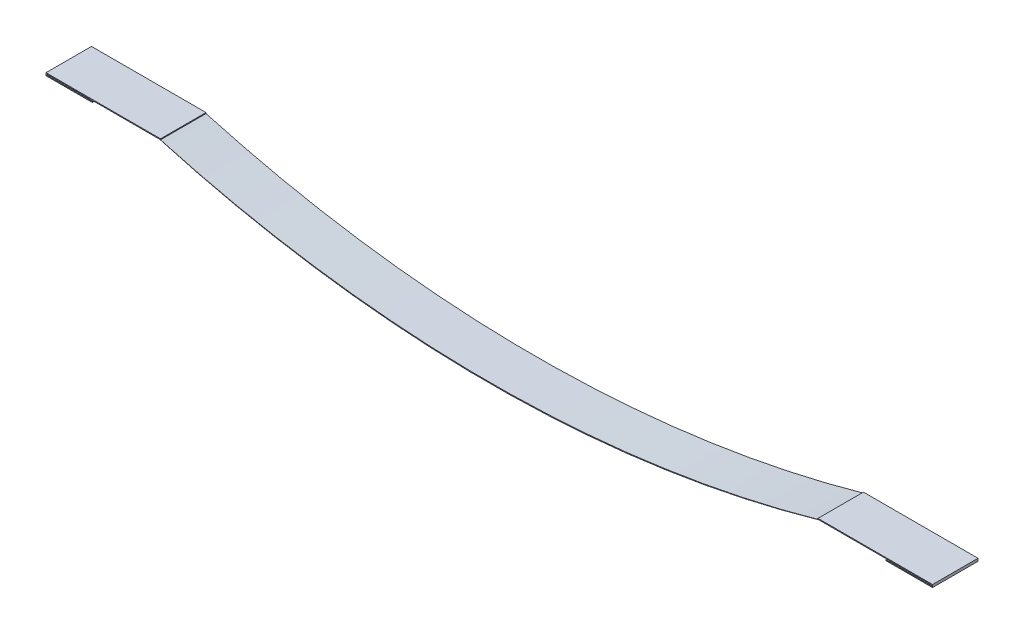
ISO-10303-21;
HEADER;
FILE_DESCRIPTION(('STEP AP214'),'2;1');
FILE_NAME('part.step','',(''),(''),'','','');
FILE_SCHEMA(('AUTOMOTIVE_DESIGN { 1 0 10303 214 1 1 1 1 }'));
ENDSEC;
DATA;
#1=APPLICATION_CONTEXT('core data for automotive mechanical design processes');
#2=APPLICATION_PROTOCOL_DEFINITION('international standard','automotive_design',2000,#1);
#3=PRODUCT_CONTEXT('',#1,'mechanical');
#4=PRODUCT('Part','Part','',(#3));
#5=PRODUCT_RELATED_PRODUCT_CATEGORY('part','',(#4));
#6=PRODUCT_DEFINITION_FORMATION('','',#4);
#7=PRODUCT_DEFINITION_CONTEXT('part definition',#1,'design');
#8=PRODUCT_DEFINITION('design','',#6,#7);
#9=PRODUCT_DEFINITION_SHAPE('','',#8);
#10=(LENGTH_UNIT() NAMED_UNIT(*) SI_UNIT(.MILLI.,.METRE.));
#11=(NAMED_UNIT(*) PLANE_ANGLE_UNIT() SI_UNIT($,.RADIAN.));
#12=(NAMED_UNIT(*) SI_UNIT($,.STERADIAN.) SOLID_ANGLE_UNIT());
#13=UNCERTAINTY_MEASURE_WITH_UNIT(LENGTH_MEASURE(1.E-05),#10,'distance_accuracy_value','');
#14=(GEOMETRIC_REPRESENTATION_CONTEXT(3) GLOBAL_UNCERTAINTY_ASSIGNED_CONTEXT((#13)) GLOBAL_UNIT_ASSIGNED_CONTEXT((#10,
#11,#12)) REPRESENTATION_CONTEXT('',''));
#15=CARTESIAN_POINT('',(0.,0.,0.));
#16=DIRECTION('',(0.,0.,1.));
#17=DIRECTION('',(1.,0.,0.));
#18=AXIS2_PLACEMENT_3D('',#15,#16,#17);
#19=CARTESIAN_POINT('',(-1.38777878078145E-13,1283.41361003861,50.8));
#20=DIRECTION('',(0.,0.,1.));
#21=DIRECTION('',(1.,0.,0.));
#22=AXIS2_PLACEMENT_3D('',#19,#20,#21);
#23=PLANE('',#22);
#24=DIRECTION('',(1.,0.,0.));
#25=VECTOR('',#24,1.);
#26=CARTESIAN_POINT('',(-495.3,-1.99999999999996,50.8));
#27=LINE('',#26,#25);
#28=CARTESIAN_POINT('',(-495.3,-1.99999999999996,50.8));
#29=VERTEX_POINT('',#28);
#30=CARTESIAN_POINT('',(-443.5,-1.99999999999995,50.8));
#31=VERTEX_POINT('',#30);
#32=EDGE_CURVE('E286',#29,#31,#27,.T.);
#33=ORIENTED_EDGE('',*,*,#32,.T.);
#34=DIRECTION('',(0.,1.,0.));
#35=VECTOR('',#34,1.);
#36=CARTESIAN_POINT('',(-443.5,-1.99999999999995,50.8));
#37=LINE('',#36,#35);
#38=CARTESIAN_POINT('',(-443.5,0.,50.8));
#39=VERTEX_POINT('',#38);
#40=EDGE_CURVE('E289',#31,#39,#37,.T.);
#41=ORIENTED_EDGE('',*,*,#40,.T.);
#42=DIRECTION('',(1.,0.,0.));
#43=VECTOR('',#42,1.);
#44=CARTESIAN_POINT('',(-368.3,0.,50.8));
#45=LINE('',#44,#43);
#46=CARTESIAN_POINT('',(-368.3,2.22044604925031E-13,50.8));
#47=VERTEX_POINT('',#46);
#48=EDGE_CURVE('E293',#39,#47,#45,.T.);
#49=ORIENTED_EDGE('',*,*,#48,.T.);
#50=CARTESIAN_POINT('',(-1.38777878078145E-13,1283.41361003861,50.8));
#51=DIRECTION('',(0.,0.,1.));
#52=DIRECTION('',(1.,0.,0.));
#53=AXIS2_PLACEMENT_3D('',#50,#51,#52);
#54=CIRCLE('',#53,1335.21361003861);
#55=CARTESIAN_POINT('',(368.3,1.14710452323366E-13,50.8));
#56=VERTEX_POINT('',#55);
#57=EDGE_CURVE('E296',#47,#56,#54,.T.);
#58=ORIENTED_EDGE('',*,*,#57,.T.);
#59=DIRECTION('',(1.,0.,0.));
#60=VECTOR('',#59,1.);
#61=CARTESIAN_POINT('',(368.3,1.14710452323366E-13,50.8));
#62=LINE('',#61,#60);
#63=CARTESIAN_POINT('',(443.5,1.23919796252954E-13,50.8));
#64=VERTEX_POINT('',#63);
#65=EDGE_CURVE('E299',#56,#64,#62,.T.);
#66=ORIENTED_EDGE('',*,*,#65,.T.);
#67=DIRECTION('',(0.,-1.,0.));
#68=VECTOR('',#67,1.);
#69=CARTESIAN_POINT('',(443.5,-1.99999999999984,50.8));
#70=LINE('',#69,#68);
#71=CARTESIAN_POINT('',(443.5,-1.99999999999984,50.8));
#72=VERTEX_POINT('',#71);
#73=EDGE_CURVE('E302',#64,#72,#70,.T.);
#74=ORIENTED_EDGE('',*,*,#73,.T.);
#75=DIRECTION('',(1.,0.,0.));
#76=VECTOR('',#75,1.);
#77=CARTESIAN_POINT('',(444.5,-1.99999999999985,50.8));
#78=LINE('',#77,#76);
#79=CARTESIAN_POINT('',(495.3,-1.99999999999983,50.8));
#80=VERTEX_POINT('',#79);
#81=EDGE_CURVE('E305',#72,#80,#78,.T.);
#82=ORIENTED_EDGE('',*,*,#81,.T.);
#83=DIRECTION('',(0.,1.,0.));
#84=VECTOR('',#83,1.);
#85=CARTESIAN_POINT('',(495.3,1.00000000000014,50.8));
#86=LINE('',#85,#84);
#87=CARTESIAN_POINT('',(495.3,1.00000000000014,50.8));
#88=VERTEX_POINT('',#87);
#89=EDGE_CURVE('E308',#80,#88,#86,.T.);
#90=ORIENTED_EDGE('',*,*,#89,.T.);
#91=DIRECTION('',(-1.,0.,0.));
#92=VECTOR('',#91,1.);
#93=CARTESIAN_POINT('',(444.5,1.00000000000015,50.8));
#94=LINE('',#93,#92);
#95=CARTESIAN_POINT('',(367.3,1.00000000000011,50.8));
#96=VERTEX_POINT('',#95);
#97=EDGE_CURVE('E311',#88,#96,#94,.T.);
#98=ORIENTED_EDGE('',*,*,#97,.T.);
#99=DIRECTION('',(0.,-1.,0.));
#100=VECTOR('',#99,1.);
#101=CARTESIAN_POINT('',(367.3,1.00000000000011,50.8));
#102=LINE('',#101,#100);
#103=CARTESIAN_POINT('',(367.3,2.22044604925031E-13,50.8));
#104=VERTEX_POINT('',#103);
#105=EDGE_CURVE('E314',#96,#104,#102,.T.);
#106=ORIENTED_EDGE('',*,*,#105,.T.);
#107=CARTESIAN_POINT('',(-1.66533453693773E-13,1302.44734251968,50.8));
#108=DIRECTION('',(0.,0.,-1.));
#109=DIRECTION('',(1.,0.,0.));
#110=AXIS2_PLACEMENT_3D('',#107,#108,#109);
#111=CIRCLE('',#110,1353.24734251968);
#112=CARTESIAN_POINT('',(-367.3,0.,50.8));
#113=VERTEX_POINT('',#112);
#114=EDGE_CURVE('E317',#104,#113,#111,.T.);
#115=ORIENTED_EDGE('',*,*,#114,.T.);
#116=DIRECTION('',(0.,1.,0.));
#117=VECTOR('',#116,1.);
#118=CARTESIAN_POINT('',(-367.3,1.00000000000002,50.8));
#119=LINE('',#118,#117);
#120=CARTESIAN_POINT('',(-367.3,1.00000000000002,50.8));
#121=VERTEX_POINT('',#120);
#122=EDGE_CURVE('E320',#113,#121,#119,.T.);
#123=ORIENTED_EDGE('',*,*,#122,.T.);
#124=DIRECTION('',(-1.,0.,0.));
#125=VECTOR('',#124,1.);
#126=CARTESIAN_POINT('',(-368.3,1.00000000000002,50.8));
#127=LINE('',#126,#125);
#128=CARTESIAN_POINT('',(-495.3,1.00000000000001,50.8));
#129=VERTEX_POINT('',#128);
#130=EDGE_CURVE('E323',#121,#129,#127,.T.);
#131=ORIENTED_EDGE('',*,*,#130,.T.);
#132=DIRECTION('',(0.,-1.,0.));
#133=VECTOR('',#132,1.);
#134=CARTESIAN_POINT('',(-495.3,1.00000000000001,50.8));
#135=LINE('',#134,#133);
#136=EDGE_CURVE('E326',#129,#29,#135,.T.);
#137=ORIENTED_EDGE('',*,*,#136,.T.);
#138=EDGE_LOOP('',(#33,#41,#49,#58,#66,#74,#82,#90,#98,#106,#115,#123,#131,#137));
#139=FACE_BOUND('',#138,.T.);
#140=DIRECTION('',(0.,1.,0.));
#141=VECTOR('',#140,1.);
#142=CARTESIAN_POINT('',(-444.5,-0.999999999999956,50.8));
#143=LINE('',#142,#141);
#144=CARTESIAN_POINT('',(-444.5,-0.999999999999956,50.8));
#145=VERTEX_POINT('',#144);
#146=CARTESIAN_POINT('',(-444.5,0.,50.8));
#147=VERTEX_POINT('',#146);
#148=EDGE_CURVE('E246',#145,#147,#143,.T.);
#149=ORIENTED_EDGE('',*,*,#148,.F.);
#150=DIRECTION('',(1.,0.,0.));
#151=VECTOR('',#150,1.);
#152=CARTESIAN_POINT('',(-494.3,-0.999999999999967,50.8));
#153=LINE('',#152,#151);
#154=CARTESIAN_POINT('',(-494.3,-0.999999999999967,50.8));
#155=VERTEX_POINT('',#154);
#156=EDGE_CURVE('E243',#155,#145,#153,.T.);
#157=ORIENTED_EDGE('',*,*,#156,.F.);
#158=DIRECTION('',(0.,-1.,0.));
#159=VECTOR('',#158,1.);
#160=CARTESIAN_POINT('',(-494.3,0.,50.8));
#161=LINE('',#160,#159);
#162=CARTESIAN_POINT('',(-494.3,0.,50.8));
#163=VERTEX_POINT('',#162);
#164=EDGE_CURVE('E254',#163,#155,#161,.T.);
#165=ORIENTED_EDGE('',*,*,#164,.F.);
#166=DIRECTION('',(-1.,0.,0.));
#167=VECTOR('',#166,1.);
#168=CARTESIAN_POINT('',(-444.5,0.,50.8));
#169=LINE('',#168,#167);
#170=EDGE_CURVE('E250',#147,#163,#169,.T.);
#171=ORIENTED_EDGE('',*,*,#170,.F.);
#172=EDGE_LOOP('',(#149,#157,#165,#171));
#173=FACE_BOUND('',#172,.T.);
#174=DIRECTION('',(0.,-1.,0.));
#175=VECTOR('',#174,1.);
#176=CARTESIAN_POINT('',(444.5,-0.999999999999847,50.8));
#177=LINE('',#176,#175);
#178=CARTESIAN_POINT('',(444.5,1.53323389516105E-13,50.8));
#179=VERTEX_POINT('',#178);
#180=CARTESIAN_POINT('',(444.5,-0.999999999999847,50.8));
#181=VERTEX_POINT('',#180);
#182=EDGE_CURVE('E204',#179,#181,#177,.T.);
#183=ORIENTED_EDGE('',*,*,#182,.F.);
#184=DIRECTION('',(-1.,0.,0.));
#185=VECTOR('',#184,1.);
#186=CARTESIAN_POINT('',(444.5,1.53323389516105E-13,50.8));
#187=LINE('',#186,#185);
#188=CARTESIAN_POINT('',(494.3,1.32344285157557E-13,50.8));
#189=VERTEX_POINT('',#188);
#190=EDGE_CURVE('E195',#189,#179,#187,.T.);
#191=ORIENTED_EDGE('',*,*,#190,.F.);
#192=DIRECTION('',(0.,1.,0.));
#193=VECTOR('',#192,1.);
#194=CARTESIAN_POINT('',(494.3,1.32344285157557E-13,50.8));
#195=LINE('',#194,#193);
#196=CARTESIAN_POINT('',(494.3,-0.99999999999989,50.8));
#197=VERTEX_POINT('',#196);
#198=EDGE_CURVE('E221',#197,#189,#195,.T.);
#199=ORIENTED_EDGE('',*,*,#198,.F.);
#200=DIRECTION('',(1.,0.,0.));
#201=VECTOR('',#200,1.);
#202=CARTESIAN_POINT('',(494.3,-0.999999999999846,50.8));
#203=LINE('',#202,#201);
#204=EDGE_CURVE('E217',#181,#197,#203,.T.);
#205=ORIENTED_EDGE('',*,*,#204,.F.);
#206=EDGE_LOOP('',(#183,#191,#199,#205));
#207=FACE_BOUND('',#206,.T.);
#208=ADVANCED_FACE('F45',(#139,#173,#207),#23,.T.);
#209=CARTESIAN_POINT('',(-1.38777878078145E-13,1283.41361003861,0.));
#210=DIRECTION('',(0.,0.,1.));
#211=DIRECTION('',(1.,0.,0.));
#212=AXIS2_PLACEMENT_3D('',#209,#210,#211);
#213=PLANE('',#212);
#214=DIRECTION('',(1.,0.,0.));
#215=VECTOR('',#214,1.);
#216=CARTESIAN_POINT('',(-494.3,-0.999999999999967,0.));
#217=LINE('',#216,#215);
#218=CARTESIAN_POINT('',(-494.3,-1.00000000000011,0.));
#219=VERTEX_POINT('',#218);
#220=CARTESIAN_POINT('',(-444.5,-0.999999999999956,0.));
#221=VERTEX_POINT('',#220);
#222=EDGE_CURVE('E213',#219,#221,#217,.T.);
#223=ORIENTED_EDGE('',*,*,#222,.T.);
#224=DIRECTION('',(0.,1.,0.));
#225=VECTOR('',#224,1.);
#226=CARTESIAN_POINT('',(-444.5,-0.999999999999956,0.));
#227=LINE('',#226,#225);
#228=CARTESIAN_POINT('',(-444.5,0.,0.));
#229=VERTEX_POINT('',#228);
#230=EDGE_CURVE('E261',#221,#229,#227,.T.);
#231=ORIENTED_EDGE('',*,*,#230,.T.);
#232=DIRECTION('',(-1.,0.,0.));
#233=VECTOR('',#232,1.);
#234=CARTESIAN_POINT('',(-444.5,0.,0.));
#235=LINE('',#234,#233);
#236=CARTESIAN_POINT('',(-494.3,0.,0.));
#237=VERTEX_POINT('',#236);
#238=EDGE_CURVE('E265',#229,#237,#235,.T.);
#239=ORIENTED_EDGE('',*,*,#238,.T.);
#240=DIRECTION('',(0.,-1.,0.));
#241=VECTOR('',#240,1.);
#242=CARTESIAN_POINT('',(-494.3,0.,0.));
#243=LINE('',#242,#241);
#244=EDGE_CURVE('E247',#237,#219,#243,.T.);
#245=ORIENTED_EDGE('',*,*,#244,.T.);
#246=EDGE_LOOP('',(#223,#231,#239,#245));
#247=FACE_BOUND('',#246,.T.);
#248=DIRECTION('',(1.,0.,0.));
#249=VECTOR('',#248,1.);
#250=CARTESIAN_POINT('',(-444.5,-1.99999999999996,0.));
#251=LINE('',#250,#249);
#252=CARTESIAN_POINT('',(-495.3,-1.99999999999996,0.));
#253=VERTEX_POINT('',#252);
#254=CARTESIAN_POINT('',(-443.5,-1.99999999999995,0.));
#255=VERTEX_POINT('',#254);
#256=EDGE_CURVE('E285',#253,#255,#251,.T.);
#257=ORIENTED_EDGE('',*,*,#256,.F.);
#258=DIRECTION('',(0.,-1.,0.));
#259=VECTOR('',#258,1.);
#260=CARTESIAN_POINT('',(-495.3,1.00000000000001,0.));
#261=LINE('',#260,#259);
#262=CARTESIAN_POINT('',(-495.3,1.00000000000001,0.));
#263=VERTEX_POINT('',#262);
#264=EDGE_CURVE('E290',#263,#253,#261,.T.);
#265=ORIENTED_EDGE('',*,*,#264,.F.);
#266=DIRECTION('',(-1.,0.,0.));
#267=VECTOR('',#266,1.);
#268=CARTESIAN_POINT('',(-444.5,1.00000000000004,0.));
#269=LINE('',#268,#267);
#270=CARTESIAN_POINT('',(-367.3,1.00000000000002,0.));
#271=VERTEX_POINT('',#270);
#272=EDGE_CURVE('E368',#271,#263,#269,.T.);
#273=ORIENTED_EDGE('',*,*,#272,.F.);
#274=DIRECTION('',(0.,1.,0.));
#275=VECTOR('',#274,1.);
#276=CARTESIAN_POINT('',(-367.3,1.00000000000002,0.));
#277=LINE('',#276,#275);
#278=CARTESIAN_POINT('',(-367.3,0.,0.));
#279=VERTEX_POINT('',#278);
#280=EDGE_CURVE('E364',#279,#271,#277,.T.);
#281=ORIENTED_EDGE('',*,*,#280,.F.);
#282=CARTESIAN_POINT('',(-1.66533453693773E-13,1302.44734251968,0.));
#283=DIRECTION('',(0.,0.,-1.));
#284=DIRECTION('',(1.,0.,0.));
#285=AXIS2_PLACEMENT_3D('',#282,#283,#284);
#286=CIRCLE('',#285,1353.24734251968);
#287=CARTESIAN_POINT('',(367.3,2.22044604925031E-13,0.));
#288=VERTEX_POINT('',#287);
#289=EDGE_CURVE('E361',#288,#279,#286,.T.);
#290=ORIENTED_EDGE('',*,*,#289,.F.);
#291=DIRECTION('',(0.,-1.,0.));
#292=VECTOR('',#291,1.);
#293=CARTESIAN_POINT('',(367.3,1.00000000000011,0.));
#294=LINE('',#293,#292);
#295=CARTESIAN_POINT('',(367.3,1.00000000000011,0.));
#296=VERTEX_POINT('',#295);
#297=EDGE_CURVE('E358',#296,#288,#294,.T.);
#298=ORIENTED_EDGE('',*,*,#297,.F.);
#299=DIRECTION('',(-1.,0.,0.));
#300=VECTOR('',#299,1.);
#301=CARTESIAN_POINT('',(368.3,1.00000000000011,0.));
#302=LINE('',#301,#300);
#303=CARTESIAN_POINT('',(495.3,1.00000000000014,0.));
#304=VERTEX_POINT('',#303);
#305=EDGE_CURVE('E355',#304,#296,#302,.T.);
#306=ORIENTED_EDGE('',*,*,#305,.F.);
#307=DIRECTION('',(0.,1.,0.));
#308=VECTOR('',#307,1.);
#309=CARTESIAN_POINT('',(495.3,1.00000000000014,0.));
#310=LINE('',#309,#308);
#311=CARTESIAN_POINT('',(495.3,-1.99999999999983,0.));
#312=VERTEX_POINT('',#311);
#313=EDGE_CURVE('E351',#312,#304,#310,.T.);
#314=ORIENTED_EDGE('',*,*,#313,.F.);
#315=DIRECTION('',(1.,0.,0.));
#316=VECTOR('',#315,1.);
#317=CARTESIAN_POINT('',(495.3,-1.99999999999983,0.));
#318=LINE('',#317,#316);
#319=CARTESIAN_POINT('',(443.5,-1.99999999999984,0.));
#320=VERTEX_POINT('',#319);
#321=EDGE_CURVE('E348',#320,#312,#318,.T.);
#322=ORIENTED_EDGE('',*,*,#321,.F.);
#323=DIRECTION('',(0.,-1.,0.));
#324=VECTOR('',#323,1.);
#325=CARTESIAN_POINT('',(443.5,-1.99999999999984,0.));
#326=LINE('',#325,#324);
#327=CARTESIAN_POINT('',(443.5,1.23919796252954E-13,0.));
#328=VERTEX_POINT('',#327);
#329=EDGE_CURVE('E344',#328,#320,#326,.T.);
#330=ORIENTED_EDGE('',*,*,#329,.F.);
#331=DIRECTION('',(1.,0.,0.));
#332=VECTOR('',#331,1.);
#333=CARTESIAN_POINT('',(368.3,1.14710452323366E-13,0.));
#334=LINE('',#333,#332);
#335=CARTESIAN_POINT('',(368.3,1.14710452323366E-13,0.));
#336=VERTEX_POINT('',#335);
#337=EDGE_CURVE('E341',#336,#328,#334,.T.);
#338=ORIENTED_EDGE('',*,*,#337,.F.);
#339=CARTESIAN_POINT('',(-1.38777878078145E-13,1283.41361003861,0.));
#340=DIRECTION('',(0.,0.,1.));
#341=DIRECTION('',(1.,0.,0.));
#342=AXIS2_PLACEMENT_3D('',#339,#340,#341);
#343=CIRCLE('',#342,1335.21361003861);
#344=CARTESIAN_POINT('',(-368.3,2.22044604925031E-13,0.));
#345=VERTEX_POINT('',#344);
#346=EDGE_CURVE('E338',#345,#336,#343,.T.);
#347=ORIENTED_EDGE('',*,*,#346,.F.);
#348=DIRECTION('',(1.,0.,0.));
#349=VECTOR('',#348,1.);
#350=CARTESIAN_POINT('',(-368.3,0.,0.));
#351=LINE('',#350,#349);
#352=CARTESIAN_POINT('',(-443.5,0.,0.));
#353=VERTEX_POINT('',#352);
#354=EDGE_CURVE('E335',#353,#345,#351,.T.);
#355=ORIENTED_EDGE('',*,*,#354,.F.);
#356=DIRECTION('',(0.,1.,0.));
#357=VECTOR('',#356,1.);
#358=CARTESIAN_POINT('',(-443.5,-1.99999999999995,0.));
#359=LINE('',#358,#357);
#360=EDGE_CURVE('E332',#255,#353,#359,.T.);
#361=ORIENTED_EDGE('',*,*,#360,.F.);
#362=EDGE_LOOP('',(#257,#265,#273,#281,#290,#298,#306,#314,#322,#330,#338,#347,#355,#361));
#363=FACE_BOUND('',#362,.T.);
#364=DIRECTION('',(-1.,0.,0.));
#365=VECTOR('',#364,1.);
#366=CARTESIAN_POINT('',(444.5,1.53323389516105E-13,0.));
#367=LINE('',#366,#365);
#368=CARTESIAN_POINT('',(494.3,2.22044604925031E-13,0.));
#369=VERTEX_POINT('',#368);
#370=CARTESIAN_POINT('',(444.5,1.53323389516105E-13,0.));
#371=VERTEX_POINT('',#370);
#372=EDGE_CURVE('E69',#369,#371,#367,.T.);
#373=ORIENTED_EDGE('',*,*,#372,.T.);
#374=DIRECTION('',(0.,-1.,0.));
#375=VECTOR('',#374,1.);
#376=CARTESIAN_POINT('',(444.5,-0.999999999999847,0.));
#377=LINE('',#376,#375);
#378=CARTESIAN_POINT('',(444.5,-0.999999999999847,0.));
#379=VERTEX_POINT('',#378);
#380=EDGE_CURVE('E211',#371,#379,#377,.T.);
#381=ORIENTED_EDGE('',*,*,#380,.T.);
#382=DIRECTION('',(1.,0.,0.));
#383=VECTOR('',#382,1.);
#384=CARTESIAN_POINT('',(494.3,-0.999999999999846,0.));
#385=LINE('',#384,#383);
#386=CARTESIAN_POINT('',(494.3,-0.999999999999846,0.));
#387=VERTEX_POINT('',#386);
#388=EDGE_CURVE('E230',#379,#387,#385,.T.);
#389=ORIENTED_EDGE('',*,*,#388,.T.);
#390=DIRECTION('',(0.,1.,0.));
#391=VECTOR('',#390,1.);
#392=CARTESIAN_POINT('',(494.3,1.32344285157557E-13,0.));
#393=LINE('',#392,#391);
#394=EDGE_CURVE('E205',#387,#369,#393,.T.);
#395=ORIENTED_EDGE('',*,*,#394,.T.);
#396=EDGE_LOOP('',(#373,#381,#389,#395));
#397=FACE_BOUND('',#396,.T.);
#398=ADVANCED_FACE('F433',(#247,#363,#397),#213,.F.);
#399=CARTESIAN_POINT('',(-444.5,-1.99999999999996,50.8));
#400=DIRECTION('',(0.,1.,0.));
#401=DIRECTION('',(-1.,0.,0.));
#402=AXIS2_PLACEMENT_3D('',#399,#400,#401);
#403=PLANE('',#402);
#404=ORIENTED_EDGE('',*,*,#256,.T.);
#405=DIRECTION('',(0.,0.,-1.));
#406=VECTOR('',#405,1.);
#407=CARTESIAN_POINT('',(-443.5,-1.99999999999995,50.8));
#408=LINE('',#407,#406);
#409=EDGE_CURVE('E11',#31,#255,#408,.T.);
#410=ORIENTED_EDGE('',*,*,#409,.F.);
#411=ORIENTED_EDGE('',*,*,#32,.F.);
#412=DIRECTION('',(0.,0.,-1.));
#413=VECTOR('',#412,1.);
#414=CARTESIAN_POINT('',(-495.3,-1.99999999999996,50.8));
#415=LINE('',#414,#413);
#416=EDGE_CURVE('E329',#29,#253,#415,.T.);
#417=ORIENTED_EDGE('',*,*,#416,.T.);
#418=EDGE_LOOP('',(#404,#410,#411,#417));
#419=FACE_BOUND('',#418,.T.);
#420=ADVANCED_FACE('F47',(#419),#403,.F.);
#421=CARTESIAN_POINT('',(-443.5,-1.99999999999995,50.8));
#422=DIRECTION('',(-1.,0.,0.));
#423=DIRECTION('',(0.,0.,1.));
#424=AXIS2_PLACEMENT_3D('',#421,#422,#423);
#425=PLANE('',#424);
#426=ORIENTED_EDGE('',*,*,#360,.T.);
#427=DIRECTION('',(0.,0.,-1.));
#428=VECTOR('',#427,1.);
#429=CARTESIAN_POINT('',(-443.5,0.,50.8));
#430=LINE('',#429,#428);
#431=EDGE_CURVE('E54',#39,#353,#430,.T.);
#432=ORIENTED_EDGE('',*,*,#431,.F.);
#433=ORIENTED_EDGE('',*,*,#40,.F.);
#434=ORIENTED_EDGE('',*,*,#409,.T.);
#435=EDGE_LOOP('',(#426,#432,#433,#434));
#436=FACE_BOUND('',#435,.T.);
#437=ADVANCED_FACE('F451',(#436),#425,.F.);
#438=CARTESIAN_POINT('',(-368.3,0.,50.8));
#439=DIRECTION('',(0.,1.,0.));
#440=DIRECTION('',(-1.,0.,0.));
#441=AXIS2_PLACEMENT_3D('',#438,#439,#440);
#442=PLANE('',#441);
#443=ORIENTED_EDGE('',*,*,#354,.T.);
#444=DIRECTION('',(0.,0.,-1.));
#445=VECTOR('',#444,1.);
#446=CARTESIAN_POINT('',(-368.3,2.22044604925031E-13,50.8));
#447=LINE('',#446,#445);
#448=EDGE_CURVE('E417',#47,#345,#447,.T.);
#449=ORIENTED_EDGE('',*,*,#448,.F.);
#450=ORIENTED_EDGE('',*,*,#48,.F.);
#451=ORIENTED_EDGE('',*,*,#431,.T.);
#452=EDGE_LOOP('',(#443,#449,#450,#451));
#453=FACE_BOUND('',#452,.T.);
#454=ADVANCED_FACE('F426',(#453),#442,.F.);
#455=CARTESIAN_POINT('',(-1.38777878078145E-13,1283.41361003861,50.8));
#456=DIRECTION('',(0.,0.,-1.));
#457=DIRECTION('',(-1.,0.,0.));
#458=AXIS2_PLACEMENT_3D('',#455,#456,#457);
#459=CYLINDRICAL_SURFACE('',#458,1335.21361003861);
#460=ORIENTED_EDGE('',*,*,#346,.T.);
#461=DIRECTION('',(0.,0.,-1.));
#462=VECTOR('',#461,1.);
#463=CARTESIAN_POINT('',(368.3,1.14710452323366E-13,50.8));
#464=LINE('',#463,#462);
#465=EDGE_CURVE('E413',#56,#336,#464,.T.);
#466=ORIENTED_EDGE('',*,*,#465,.F.);
#467=ORIENTED_EDGE('',*,*,#57,.F.);
#468=ORIENTED_EDGE('',*,*,#448,.T.);
#469=EDGE_LOOP('',(#460,#466,#467,#468));
#470=FACE_BOUND('',#469,.T.);
#471=ADVANCED_FACE('F439',(#470),#459,.T.);
#472=CARTESIAN_POINT('',(368.3,1.14710452323366E-13,50.8));
#473=DIRECTION('',(0.,1.,0.));
#474=DIRECTION('',(-1.,0.,0.));
#475=AXIS2_PLACEMENT_3D('',#472,#473,#474);
#476=PLANE('',#475);
#477=ORIENTED_EDGE('',*,*,#337,.T.);
#478=DIRECTION('',(0.,0.,-1.));
#479=VECTOR('',#478,1.);
#480=CARTESIAN_POINT('',(443.5,1.23919796252954E-13,50.8));
#481=LINE('',#480,#479);
#482=EDGE_CURVE('E409',#64,#328,#481,.T.);
#483=ORIENTED_EDGE('',*,*,#482,.F.);
#484=ORIENTED_EDGE('',*,*,#65,.F.);
#485=ORIENTED_EDGE('',*,*,#465,.T.);
#486=EDGE_LOOP('',(#477,#483,#484,#485));
#487=FACE_BOUND('',#486,.T.);
#488=ADVANCED_FACE('F443',(#487),#476,.F.);
#489=CARTESIAN_POINT('',(443.5,-1.99999999999984,50.8));
#490=DIRECTION('',(1.,0.,0.));
#491=DIRECTION('',(0.,0.,-1.));
#492=AXIS2_PLACEMENT_3D('',#489,#490,#491);
#493=PLANE('',#492);
#494=ORIENTED_EDGE('',*,*,#329,.T.);
#495=DIRECTION('',(0.,0.,-1.));
#496=VECTOR('',#495,1.);
#497=CARTESIAN_POINT('',(443.5,-1.99999999999984,50.8));
#498=LINE('',#497,#496);
#499=EDGE_CURVE('E405',#72,#320,#498,.T.);
#500=ORIENTED_EDGE('',*,*,#499,.F.);
#501=ORIENTED_EDGE('',*,*,#73,.F.);
#502=ORIENTED_EDGE('',*,*,#482,.T.);
#503=EDGE_LOOP('',(#494,#500,#501,#502));
#504=FACE_BOUND('',#503,.T.);
#505=ADVANCED_FACE('F489',(#504),#493,.F.);
#506=CARTESIAN_POINT('',(495.3,-1.99999999999983,50.8));
#507=DIRECTION('',(0.,1.,0.));
#508=DIRECTION('',(-1.,0.,0.));
#509=AXIS2_PLACEMENT_3D('',#506,#507,#508);
#510=PLANE('',#509);
#511=ORIENTED_EDGE('',*,*,#321,.T.);
#512=DIRECTION('',(0.,0.,-1.));
#513=VECTOR('',#512,1.);
#514=CARTESIAN_POINT('',(495.3,-1.99999999999983,50.8));
#515=LINE('',#514,#513);
#516=EDGE_CURVE('E401',#80,#312,#515,.T.);
#517=ORIENTED_EDGE('',*,*,#516,.F.);
#518=ORIENTED_EDGE('',*,*,#81,.F.);
#519=ORIENTED_EDGE('',*,*,#499,.T.);
#520=EDGE_LOOP('',(#511,#517,#518,#519));
#521=FACE_BOUND('',#520,.T.);
#522=ADVANCED_FACE('F491',(#521),#510,.F.);
#523=CARTESIAN_POINT('',(495.3,1.00000000000014,50.8));
#524=DIRECTION('',(-1.,0.,0.));
#525=DIRECTION('',(0.,0.,1.));
#526=AXIS2_PLACEMENT_3D('',#523,#524,#525);
#527=PLANE('',#526);
#528=ORIENTED_EDGE('',*,*,#313,.T.);
#529=DIRECTION('',(0.,0.,-1.));
#530=VECTOR('',#529,1.);
#531=CARTESIAN_POINT('',(495.3,1.00000000000014,50.8));
#532=LINE('',#531,#530);
#533=EDGE_CURVE('E397',#88,#304,#532,.T.);
#534=ORIENTED_EDGE('',*,*,#533,.F.);
#535=ORIENTED_EDGE('',*,*,#89,.F.);
#536=ORIENTED_EDGE('',*,*,#516,.T.);
#537=EDGE_LOOP('',(#528,#534,#535,#536));
#538=FACE_BOUND('',#537,.T.);
#539=ADVANCED_FACE('F485',(#538),#527,.F.);
#540=CARTESIAN_POINT('',(368.3,1.00000000000011,50.8));
#541=DIRECTION('',(0.,-1.,0.));
#542=DIRECTION('',(1.,0.,0.));
#543=AXIS2_PLACEMENT_3D('',#540,#541,#542);
#544=PLANE('',#543);
#545=ORIENTED_EDGE('',*,*,#305,.T.);
#546=DIRECTION('',(0.,0.,-1.));
#547=VECTOR('',#546,1.);
#548=CARTESIAN_POINT('',(367.3,1.00000000000011,50.8));
#549=LINE('',#548,#547);
#550=EDGE_CURVE('E393',#96,#296,#549,.T.);
#551=ORIENTED_EDGE('',*,*,#550,.F.);
#552=ORIENTED_EDGE('',*,*,#97,.F.);
#553=ORIENTED_EDGE('',*,*,#533,.T.);
#554=EDGE_LOOP('',(#545,#551,#552,#553));
#555=FACE_BOUND('',#554,.T.);
#556=ADVANCED_FACE('F481',(#555),#544,.F.);
#557=CARTESIAN_POINT('',(367.3,1.00000000000011,50.8));
#558=DIRECTION('',(1.,0.,0.));
#559=DIRECTION('',(0.,0.,-1.));
#560=AXIS2_PLACEMENT_3D('',#557,#558,#559);
#561=PLANE('',#560);
#562=ORIENTED_EDGE('',*,*,#297,.T.);
#563=DIRECTION('',(0.,0.,-1.));
#564=VECTOR('',#563,1.);
#565=CARTESIAN_POINT('',(367.3,2.22044604925031E-13,50.8));
#566=LINE('',#565,#564);
#567=EDGE_CURVE('E389',#104,#288,#566,.T.);
#568=ORIENTED_EDGE('',*,*,#567,.F.);
#569=ORIENTED_EDGE('',*,*,#105,.F.);
#570=ORIENTED_EDGE('',*,*,#550,.T.);
#571=EDGE_LOOP('',(#562,#568,#569,#570));
#572=FACE_BOUND('',#571,.T.);
#573=ADVANCED_FACE('F476',(#572),#561,.F.);
#574=CARTESIAN_POINT('',(-1.66533453693773E-13,1302.44734251968,50.8));
#575=DIRECTION('',(0.,0.,-1.));
#576=DIRECTION('',(-1.,0.,0.));
#577=AXIS2_PLACEMENT_3D('',#574,#575,#576);
#578=CYLINDRICAL_SURFACE('',#577,1353.24734251968);
#579=ORIENTED_EDGE('',*,*,#289,.T.);
#580=DIRECTION('',(0.,0.,-1.));
#581=VECTOR('',#580,1.);
#582=CARTESIAN_POINT('',(-367.3,0.,50.8));
#583=LINE('',#582,#581);
#584=EDGE_CURVE('E385',#113,#279,#583,.T.);
#585=ORIENTED_EDGE('',*,*,#584,.F.);
#586=ORIENTED_EDGE('',*,*,#114,.F.);
#587=ORIENTED_EDGE('',*,*,#567,.T.);
#588=EDGE_LOOP('',(#579,#585,#586,#587));
#589=FACE_BOUND('',#588,.T.);
#590=ADVANCED_FACE('F471',(#589),#578,.F.);
#591=CARTESIAN_POINT('',(-367.3,1.00000000000002,50.8));
#592=DIRECTION('',(-1.,0.,0.));
#593=DIRECTION('',(0.,0.,1.));
#594=AXIS2_PLACEMENT_3D('',#591,#592,#593);
#595=PLANE('',#594);
#596=ORIENTED_EDGE('',*,*,#280,.T.);
#597=DIRECTION('',(0.,0.,-1.));
#598=VECTOR('',#597,1.);
#599=CARTESIAN_POINT('',(-367.3,1.00000000000002,50.8));
#600=LINE('',#599,#598);
#601=EDGE_CURVE('E381',#121,#271,#600,.T.);
#602=ORIENTED_EDGE('',*,*,#601,.F.);
#603=ORIENTED_EDGE('',*,*,#122,.F.);
#604=ORIENTED_EDGE('',*,*,#584,.T.);
#605=EDGE_LOOP('',(#596,#602,#603,#604));
#606=FACE_BOUND('',#605,.T.);
#607=ADVANCED_FACE('F466',(#606),#595,.F.);
#608=CARTESIAN_POINT('',(-444.5,1.00000000000004,50.8));
#609=DIRECTION('',(0.,-1.,0.));
#610=DIRECTION('',(1.,0.,0.));
#611=AXIS2_PLACEMENT_3D('',#608,#609,#610);
#612=PLANE('',#611);
#613=ORIENTED_EDGE('',*,*,#272,.T.);
#614=DIRECTION('',(0.,0.,-1.));
#615=VECTOR('',#614,1.);
#616=CARTESIAN_POINT('',(-495.3,1.00000000000001,50.8));
#617=LINE('',#616,#615);
#618=EDGE_CURVE('E377',#129,#263,#617,.T.);
#619=ORIENTED_EDGE('',*,*,#618,.F.);
#620=ORIENTED_EDGE('',*,*,#130,.F.);
#621=ORIENTED_EDGE('',*,*,#601,.T.);
#622=EDGE_LOOP('',(#613,#619,#620,#621));
#623=FACE_BOUND('',#622,.T.);
#624=ADVANCED_FACE('F461',(#623),#612,.F.);
#625=CARTESIAN_POINT('',(-495.3,1.00000000000001,50.8));
#626=DIRECTION('',(1.,0.,0.));
#627=DIRECTION('',(0.,0.,-1.));
#628=AXIS2_PLACEMENT_3D('',#625,#626,#627);
#629=PLANE('',#628);
#630=ORIENTED_EDGE('',*,*,#264,.T.);
#631=ORIENTED_EDGE('',*,*,#416,.F.);
#632=ORIENTED_EDGE('',*,*,#136,.F.);
#633=ORIENTED_EDGE('',*,*,#618,.T.);
#634=EDGE_LOOP('',(#630,#631,#632,#633));
#635=FACE_BOUND('',#634,.T.);
#636=ADVANCED_FACE('F456',(#635),#629,.F.);
#637=CARTESIAN_POINT('',(-494.3,-0.999999999999967,50.8));
#638=DIRECTION('',(0.,1.,0.));
#639=DIRECTION('',(-1.,0.,0.));
#640=AXIS2_PLACEMENT_3D('',#637,#638,#639);
#641=PLANE('',#640);
#642=ORIENTED_EDGE('',*,*,#222,.F.);
#643=DIRECTION('',(0.,0.,-1.));
#644=VECTOR('',#643,1.);
#645=CARTESIAN_POINT('',(-494.3,-0.999999999999967,50.8));
#646=LINE('',#645,#644);
#647=EDGE_CURVE('E257',#155,#219,#646,.T.);
#648=ORIENTED_EDGE('',*,*,#647,.F.);
#649=ORIENTED_EDGE('',*,*,#156,.T.);
#650=DIRECTION('',(0.,0.,-1.));
#651=VECTOR('',#650,1.);
#652=CARTESIAN_POINT('',(-444.5,-0.999999999999956,50.8));
#653=LINE('',#652,#651);
#654=EDGE_CURVE('E281',#145,#221,#653,.T.);
#655=ORIENTED_EDGE('',*,*,#654,.T.);
#656=EDGE_LOOP('',(#642,#648,#649,#655));
#657=FACE_BOUND('',#656,.T.);
#658=ADVANCED_FACE('F508',(#657),#641,.T.);
#659=CARTESIAN_POINT('',(-444.5,-0.999999999999956,50.8));
#660=DIRECTION('',(-1.,0.,0.));
#661=DIRECTION('',(0.,-1.,0.));
#662=AXIS2_PLACEMENT_3D('',#659,#660,#661);
#663=PLANE('',#662);
#664=ORIENTED_EDGE('',*,*,#230,.F.);
#665=ORIENTED_EDGE('',*,*,#654,.F.);
#666=ORIENTED_EDGE('',*,*,#148,.T.);
#667=DIRECTION('',(0.,0.,-1.));
#668=VECTOR('',#667,1.);
#669=CARTESIAN_POINT('',(-444.5,0.,50.8));
#670=LINE('',#669,#668);
#671=EDGE_CURVE('E278',#147,#229,#670,.T.);
#672=ORIENTED_EDGE('',*,*,#671,.T.);
#673=EDGE_LOOP('',(#664,#665,#666,#672));
#674=FACE_BOUND('',#673,.T.);
#675=ADVANCED_FACE('F552',(#674),#663,.T.);
#676=CARTESIAN_POINT('',(-444.5,0.,50.8));
#677=DIRECTION('',(0.,-1.,0.));
#678=DIRECTION('',(1.,0.,0.));
#679=AXIS2_PLACEMENT_3D('',#676,#677,#678);
#680=PLANE('',#679);
#681=ORIENTED_EDGE('',*,*,#238,.F.);
#682=ORIENTED_EDGE('',*,*,#671,.F.);
#683=ORIENTED_EDGE('',*,*,#170,.T.);
#684=DIRECTION('',(0.,0.,-1.));
#685=VECTOR('',#684,1.);
#686=CARTESIAN_POINT('',(-494.3,0.,50.8));
#687=LINE('',#686,#685);
#688=EDGE_CURVE('E275',#163,#237,#687,.T.);
#689=ORIENTED_EDGE('',*,*,#688,.T.);
#690=EDGE_LOOP('',(#681,#682,#683,#689));
#691=FACE_BOUND('',#690,.T.);
#692=ADVANCED_FACE('F559',(#691),#680,.T.);
#693=CARTESIAN_POINT('',(-494.3,0.,50.8));
#694=DIRECTION('',(1.,0.,0.));
#695=DIRECTION('',(0.,0.,-1.));
#696=AXIS2_PLACEMENT_3D('',#693,#694,#695);
#697=PLANE('',#696);
#698=ORIENTED_EDGE('',*,*,#244,.F.);
#699=ORIENTED_EDGE('',*,*,#688,.F.);
#700=ORIENTED_EDGE('',*,*,#164,.T.);
#701=ORIENTED_EDGE('',*,*,#647,.T.);
#702=EDGE_LOOP('',(#698,#699,#700,#701));
#703=FACE_BOUND('',#702,.T.);
#704=ADVANCED_FACE('F566',(#703),#697,.T.);
#705=CARTESIAN_POINT('',(444.5,1.53323389516105E-13,50.8));
#706=DIRECTION('',(0.,-1.,0.));
#707=DIRECTION('',(1.,0.,0.));
#708=AXIS2_PLACEMENT_3D('',#705,#706,#707);
#709=PLANE('',#708);
#710=ORIENTED_EDGE('',*,*,#372,.F.);
#711=DIRECTION('',(0.,0.,-1.));
#712=VECTOR('',#711,1.);
#713=CARTESIAN_POINT('',(494.3,1.32344285157557E-13,50.8));
#714=LINE('',#713,#712);
#715=EDGE_CURVE('E199',#189,#369,#714,.T.);
#716=ORIENTED_EDGE('',*,*,#715,.F.);
#717=ORIENTED_EDGE('',*,*,#190,.T.);
#718=DIRECTION('',(0.,0.,-1.));
#719=VECTOR('',#718,1.);
#720=CARTESIAN_POINT('',(444.5,1.53323389516105E-13,50.8));
#721=LINE('',#720,#719);
#722=EDGE_CURVE('E198',#179,#371,#721,.T.);
#723=ORIENTED_EDGE('',*,*,#722,.T.);
#724=EDGE_LOOP('',(#710,#716,#717,#723));
#725=FACE_BOUND('',#724,.T.);
#726=ADVANCED_FACE('F197',(#725),#709,.T.);
#727=CARTESIAN_POINT('',(444.5,-0.999999999999847,50.8));
#728=DIRECTION('',(1.,0.,0.));
#729=DIRECTION('',(0.,1.,0.));
#730=AXIS2_PLACEMENT_3D('',#727,#728,#729);
#731=PLANE('',#730);
#732=ORIENTED_EDGE('',*,*,#380,.F.);
#733=ORIENTED_EDGE('',*,*,#722,.F.);
#734=ORIENTED_EDGE('',*,*,#182,.T.);
#735=DIRECTION('',(0.,0.,-1.));
#736=VECTOR('',#735,1.);
#737=CARTESIAN_POINT('',(444.5,-0.999999999999847,50.8));
#738=LINE('',#737,#736);
#739=EDGE_CURVE('E214',#181,#379,#738,.T.);
#740=ORIENTED_EDGE('',*,*,#739,.T.);
#741=EDGE_LOOP('',(#732,#733,#734,#740));
#742=FACE_BOUND('',#741,.T.);
#743=ADVANCED_FACE('F208',(#742),#731,.T.);
#744=CARTESIAN_POINT('',(494.3,-0.999999999999846,50.8));
#745=DIRECTION('',(0.,1.,0.));
#746=DIRECTION('',(-1.,0.,0.));
#747=AXIS2_PLACEMENT_3D('',#744,#745,#746);
#748=PLANE('',#747);
#749=ORIENTED_EDGE('',*,*,#388,.F.);
#750=ORIENTED_EDGE('',*,*,#739,.F.);
#751=ORIENTED_EDGE('',*,*,#204,.T.);
#752=DIRECTION('',(0.,0.,-1.));
#753=VECTOR('',#752,1.);
#754=CARTESIAN_POINT('',(494.3,-0.999999999999846,50.8));
#755=LINE('',#754,#753);
#756=EDGE_CURVE('E61',#197,#387,#755,.T.);
#757=ORIENTED_EDGE('',*,*,#756,.T.);
#758=EDGE_LOOP('',(#749,#750,#751,#757));
#759=FACE_BOUND('',#758,.T.);
#760=ADVANCED_FACE('F587',(#759),#748,.T.);
#761=CARTESIAN_POINT('',(494.3,1.32344285157557E-13,50.8));
#762=DIRECTION('',(-1.,0.,0.));
#763=DIRECTION('',(0.,0.,1.));
#764=AXIS2_PLACEMENT_3D('',#761,#762,#763);
#765=PLANE('',#764);
#766=ORIENTED_EDGE('',*,*,#394,.F.);
#767=ORIENTED_EDGE('',*,*,#756,.F.);
#768=ORIENTED_EDGE('',*,*,#198,.T.);
#769=ORIENTED_EDGE('',*,*,#715,.T.);
#770=EDGE_LOOP('',(#766,#767,#768,#769));
#771=FACE_BOUND('',#770,.T.);
#772=ADVANCED_FACE('F594',(#771),#765,.T.);
#773=CLOSED_SHELL('',(#208,#398,#420,#437,#454,#471,#488,#505,#522,#539,#556,#573,#590,#607,
#624,#636,#658,#675,#692,#704,#726,#743,#760,#772));
#774=MANIFOLD_SOLID_BREP('B2',#773);
#775=ADVANCED_BREP_SHAPE_REPRESENTATION('',(#18,#774),#14);
#776=SHAPE_DEFINITION_REPRESENTATION(#9,#775);
ENDSEC;
END-ISO-10303-21;
